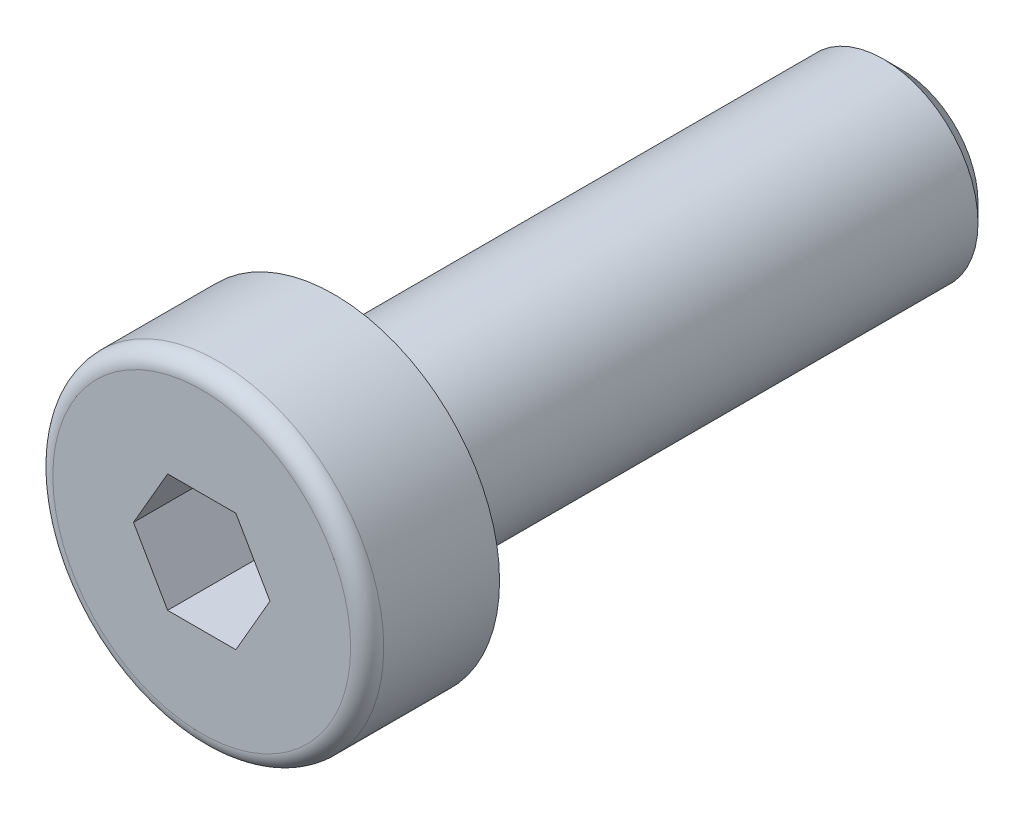
ISO-10303-21;
HEADER;
FILE_DESCRIPTION(('STEP AP214'),'2;1');
FILE_NAME('part.step','',(''),(''),'','','');
FILE_SCHEMA(('AUTOMOTIVE_DESIGN { 1 0 10303 214 1 1 1 1 }'));
ENDSEC;
DATA;
#1=APPLICATION_CONTEXT('core data for automotive mechanical design processes');
#2=APPLICATION_PROTOCOL_DEFINITION('international standard','automotive_design',2000,#1);
#3=PRODUCT_CONTEXT('',#1,'mechanical');
#4=PRODUCT('Part','Part','',(#3));
#5=PRODUCT_RELATED_PRODUCT_CATEGORY('part','',(#4));
#6=PRODUCT_DEFINITION_FORMATION('','',#4);
#7=PRODUCT_DEFINITION_CONTEXT('part definition',#1,'design');
#8=PRODUCT_DEFINITION('design','',#6,#7);
#9=PRODUCT_DEFINITION_SHAPE('','',#8);
#10=(LENGTH_UNIT() NAMED_UNIT(*) SI_UNIT(.MILLI.,.METRE.));
#11=(NAMED_UNIT(*) PLANE_ANGLE_UNIT() SI_UNIT($,.RADIAN.));
#12=(NAMED_UNIT(*) SI_UNIT($,.STERADIAN.) SOLID_ANGLE_UNIT());
#13=UNCERTAINTY_MEASURE_WITH_UNIT(LENGTH_MEASURE(1.E-05),#10,'distance_accuracy_value','');
#14=(GEOMETRIC_REPRESENTATION_CONTEXT(3) GLOBAL_UNCERTAINTY_ASSIGNED_CONTEXT((#13)) GLOBAL_UNIT_ASSIGNED_CONTEXT((#10,
#11,#12)) REPRESENTATION_CONTEXT('',''));
#15=CARTESIAN_POINT('',(0.,0.,0.));
#16=DIRECTION('',(0.,0.,1.));
#17=DIRECTION('',(1.,0.,0.));
#18=AXIS2_PLACEMENT_3D('',#15,#16,#17);
#19=CARTESIAN_POINT('',(0.,0.,2.8));
#20=DIRECTION('',(0.,0.,1.));
#21=DIRECTION('',(1.,0.,0.));
#22=AXIS2_PLACEMENT_3D('',#19,#20,#21);
#23=PLANE('',#22);
#24=CARTESIAN_POINT('',(0.,0.,2.8));
#25=DIRECTION('',(0.,0.,1.));
#26=DIRECTION('',(1.,0.,0.));
#27=AXIS2_PLACEMENT_3D('',#24,#25,#26);
#28=CIRCLE('',#27,3.15);
#29=CARTESIAN_POINT('',(3.15,0.,2.8));
#30=VERTEX_POINT('',#29);
#31=EDGE_CURVE('E125',#30,#30,#28,.T.);
#32=ORIENTED_EDGE('',*,*,#31,.T.);
#33=EDGE_LOOP('',(#32));
#34=FACE_BOUND('',#33,.T.);
#35=DIRECTION('',(1.,0.,0.));
#36=VECTOR('',#35,1.);
#37=CARTESIAN_POINT('',(-0.7216875,1.24999941718736,2.8));
#38=LINE('',#37,#36);
#39=CARTESIAN_POINT('',(-0.7216875,1.24999941718736,2.8));
#40=VERTEX_POINT('',#39);
#41=CARTESIAN_POINT('',(0.7216875,1.24999941718736,2.8));
#42=VERTEX_POINT('',#41);
#43=EDGE_CURVE('E122',#40,#42,#38,.T.);
#44=ORIENTED_EDGE('',*,*,#43,.T.);
#45=DIRECTION('',(0.5,-0.866025403784439,0.));
#46=VECTOR('',#45,1.);
#47=CARTESIAN_POINT('',(0.7216875,1.24999941718736,2.8));
#48=LINE('',#47,#46);
#49=CARTESIAN_POINT('',(1.443375,0.,2.8));
#50=VERTEX_POINT('',#49);
#51=EDGE_CURVE('E92',#42,#50,#48,.T.);
#52=ORIENTED_EDGE('',*,*,#51,.T.);
#53=DIRECTION('',(-0.5,-0.866025403784439,0.));
#54=VECTOR('',#53,1.);
#55=CARTESIAN_POINT('',(1.443375,0.,2.8));
#56=LINE('',#55,#54);
#57=CARTESIAN_POINT('',(0.7216875,-1.24999941718736,2.8));
#58=VERTEX_POINT('',#57);
#59=EDGE_CURVE('E104',#50,#58,#56,.T.);
#60=ORIENTED_EDGE('',*,*,#59,.T.);
#61=DIRECTION('',(-1.,0.,0.));
#62=VECTOR('',#61,1.);
#63=CARTESIAN_POINT('',(0.7216875,-1.24999941718736,2.8));
#64=LINE('',#63,#62);
#65=CARTESIAN_POINT('',(-0.7216875,-1.24999941718736,2.8));
#66=VERTEX_POINT('',#65);
#67=EDGE_CURVE('E402',#58,#66,#64,.T.);
#68=ORIENTED_EDGE('',*,*,#67,.T.);
#69=DIRECTION('',(-0.5,0.866025403784439,0.));
#70=VECTOR('',#69,1.);
#71=CARTESIAN_POINT('',(-0.7216875,-1.24999941718736,2.8));
#72=LINE('',#71,#70);
#73=CARTESIAN_POINT('',(-1.443375,0.,2.8));
#74=VERTEX_POINT('',#73);
#75=EDGE_CURVE('E406',#66,#74,#72,.T.);
#76=ORIENTED_EDGE('',*,*,#75,.T.);
#77=DIRECTION('',(0.5,0.866025403784439,0.));
#78=VECTOR('',#77,1.);
#79=CARTESIAN_POINT('',(-1.443375,0.,2.8));
#80=LINE('',#79,#78);
#81=EDGE_CURVE('E88',#74,#40,#80,.T.);
#82=ORIENTED_EDGE('',*,*,#81,.T.);
#83=EDGE_LOOP('',(#44,#52,#60,#68,#76,#82));
#84=FACE_BOUND('',#83,.T.);
#85=ADVANCED_FACE('F15',(#34,#84),#23,.T.);
#86=CARTESIAN_POINT('',(0.,1.621125,-12.));
#87=DIRECTION('',(0.,0.,-1.));
#88=DIRECTION('',(-1.,0.,0.));
#89=AXIS2_PLACEMENT_3D('',#86,#87,#88);
#90=PLANE('',#89);
#91=CARTESIAN_POINT('',(0.,0.,-12.));
#92=DIRECTION('',(0.,0.,1.));
#93=DIRECTION('',(1.,0.,0.));
#94=AXIS2_PLACEMENT_3D('',#91,#92,#93);
#95=CIRCLE('',#94,1.621125);
#96=CARTESIAN_POINT('',(1.621125,0.,-12.));
#97=VERTEX_POINT('',#96);
#98=EDGE_CURVE('E10',#97,#97,#95,.T.);
#99=ORIENTED_EDGE('',*,*,#98,.F.);
#100=EDGE_LOOP('',(#99));
#101=FACE_BOUND('',#100,.T.);
#102=ADVANCED_FACE('F17',(#101),#90,.T.);
#103=CARTESIAN_POINT('',(0.,0.,-11.621125));
#104=DIRECTION('',(0.,0.,1.));
#105=DIRECTION('',(1.,0.,0.));
#106=AXIS2_PLACEMENT_3D('',#103,#104,#105);
#107=CONICAL_SURFACE('',#106,2.,0.785398163397445);
#108=ORIENTED_EDGE('',*,*,#98,.T.);
#109=EDGE_LOOP('',(#108));
#110=FACE_BOUND('',#109,.T.);
#111=CARTESIAN_POINT('',(0.,0.,-11.621125));
#112=DIRECTION('',(0.,0.,1.));
#113=DIRECTION('',(1.,0.,0.));
#114=AXIS2_PLACEMENT_3D('',#111,#112,#113);
#115=CIRCLE('',#114,2.);
#116=CARTESIAN_POINT('',(2.,0.,-11.621125));
#117=VERTEX_POINT('',#116);
#118=EDGE_CURVE('E24',#117,#117,#115,.T.);
#119=ORIENTED_EDGE('',*,*,#118,.F.);
#120=EDGE_LOOP('',(#119));
#121=FACE_BOUND('',#120,.T.);
#122=ADVANCED_FACE('F166',(#110,#121),#107,.T.);
#123=CARTESIAN_POINT('',(0.,0.,2.8));
#124=DIRECTION('',(0.,0.,1.));
#125=DIRECTION('',(1.,0.,0.));
#126=AXIS2_PLACEMENT_3D('',#123,#124,#125);
#127=CYLINDRICAL_SURFACE('',#126,2.);
#128=ORIENTED_EDGE('',*,*,#118,.T.);
#129=EDGE_LOOP('',(#128));
#130=FACE_BOUND('',#129,.T.);
#131=CARTESIAN_POINT('',(0.,0.,-0.857230749717659));
#132=DIRECTION('',(0.,0.,1.));
#133=DIRECTION('',(1.,0.,0.));
#134=AXIS2_PLACEMENT_3D('',#131,#132,#133);
#135=CIRCLE('',#134,2.);
#136=CARTESIAN_POINT('',(2.,0.,-0.857230749717659));
#137=VERTEX_POINT('',#136);
#138=EDGE_CURVE('E153',#137,#137,#135,.T.);
#139=ORIENTED_EDGE('',*,*,#138,.F.);
#140=EDGE_LOOP('',(#139));
#141=FACE_BOUND('',#140,.T.);
#142=ADVANCED_FACE('F163',(#130,#141),#127,.T.);
#143=CARTESIAN_POINT('',(0.,1.621125,-0.857230749717659));
#144=DIRECTION('',(0.,0.,1.));
#145=DIRECTION('',(1.,0.,0.));
#146=AXIS2_PLACEMENT_3D('',#143,#144,#145);
#147=PLANE('',#146);
#148=ORIENTED_EDGE('',*,*,#138,.T.);
#149=EDGE_LOOP('',(#148));
#150=FACE_BOUND('',#149,.T.);
#151=CARTESIAN_POINT('',(0.,0.,-0.857230749717659));
#152=DIRECTION('',(0.,0.,1.));
#153=DIRECTION('',(1.,0.,0.));
#154=AXIS2_PLACEMENT_3D('',#151,#152,#153);
#155=CIRCLE('',#154,1.621125);
#156=CARTESIAN_POINT('',(1.621125,0.,-0.857230749717659));
#157=VERTEX_POINT('',#156);
#158=EDGE_CURVE('E149',#157,#157,#155,.T.);
#159=ORIENTED_EDGE('',*,*,#158,.F.);
#160=EDGE_LOOP('',(#159));
#161=FACE_BOUND('',#160,.T.);
#162=ADVANCED_FACE('F174',(#150,#161),#147,.T.);
#163=CARTESIAN_POINT('',(0.,0.,-0.201));
#164=DIRECTION('',(0.,0.,1.));
#165=DIRECTION('',(1.,0.,0.));
#166=AXIS2_PLACEMENT_3D('',#163,#164,#165);
#167=CONICAL_SURFACE('',#166,2.,0.523598775598299);
#168=ORIENTED_EDGE('',*,*,#158,.T.);
#169=EDGE_LOOP('',(#168));
#170=FACE_BOUND('',#169,.T.);
#171=CARTESIAN_POINT('',(0.,0.,-0.201));
#172=DIRECTION('',(0.,0.,1.));
#173=DIRECTION('',(1.,0.,0.));
#174=AXIS2_PLACEMENT_3D('',#171,#172,#173);
#175=CIRCLE('',#174,2.);
#176=CARTESIAN_POINT('',(2.,0.,-0.201));
#177=VERTEX_POINT('',#176);
#178=EDGE_CURVE('E145',#177,#177,#175,.T.);
#179=ORIENTED_EDGE('',*,*,#178,.F.);
#180=EDGE_LOOP('',(#179));
#181=FACE_BOUND('',#180,.T.);
#182=ADVANCED_FACE('F206',(#170,#181),#167,.T.);
#183=CARTESIAN_POINT('',(0.,0.,2.8));
#184=DIRECTION('',(0.,0.,1.));
#185=DIRECTION('',(1.,0.,0.));
#186=AXIS2_PLACEMENT_3D('',#183,#184,#185);
#187=CYLINDRICAL_SURFACE('',#186,2.);
#188=ORIENTED_EDGE('',*,*,#178,.T.);
#189=EDGE_LOOP('',(#188));
#190=FACE_BOUND('',#189,.T.);
#191=CARTESIAN_POINT('',(0.,0.,-0.2));
#192=DIRECTION('',(0.,0.,1.));
#193=DIRECTION('',(1.,0.,0.));
#194=AXIS2_PLACEMENT_3D('',#191,#192,#193);
#195=CIRCLE('',#194,2.);
#196=CARTESIAN_POINT('',(2.,0.,-0.2));
#197=VERTEX_POINT('',#196);
#198=EDGE_CURVE('E141',#197,#197,#195,.T.);
#199=ORIENTED_EDGE('',*,*,#198,.F.);
#200=EDGE_LOOP('',(#199));
#201=FACE_BOUND('',#200,.T.);
#202=ADVANCED_FACE('F202',(#190,#201),#187,.T.);
#203=CARTESIAN_POINT('',(0.,0.,-0.2));
#204=DIRECTION('',(0.,0.,1.));
#205=DIRECTION('',(1.,0.,0.));
#206=AXIS2_PLACEMENT_3D('',#203,#204,#205);
#207=TOROIDAL_SURFACE('',#206,2.2,0.2);
#208=ORIENTED_EDGE('',*,*,#198,.T.);
#209=EDGE_LOOP('',(#208));
#210=FACE_BOUND('',#209,.T.);
#211=CARTESIAN_POINT('',(0.,0.,0.));
#212=DIRECTION('',(0.,0.,1.));
#213=DIRECTION('',(1.,0.,0.));
#214=AXIS2_PLACEMENT_3D('',#211,#212,#213);
#215=CIRCLE('',#214,2.2);
#216=CARTESIAN_POINT('',(2.2,0.,0.));
#217=VERTEX_POINT('',#216);
#218=EDGE_CURVE('E137',#217,#217,#215,.T.);
#219=ORIENTED_EDGE('',*,*,#218,.F.);
#220=EDGE_LOOP('',(#219));
#221=FACE_BOUND('',#220,.T.);
#222=ADVANCED_FACE('F198',(#210,#221),#207,.F.);
#223=CARTESIAN_POINT('',(0.,3.5,0.));
#224=DIRECTION('',(0.,0.,-1.));
#225=DIRECTION('',(-1.,0.,0.));
#226=AXIS2_PLACEMENT_3D('',#223,#224,#225);
#227=PLANE('',#226);
#228=ORIENTED_EDGE('',*,*,#218,.T.);
#229=EDGE_LOOP('',(#228));
#230=FACE_BOUND('',#229,.T.);
#231=CARTESIAN_POINT('',(0.,0.,0.));
#232=DIRECTION('',(0.,0.,1.));
#233=DIRECTION('',(1.,0.,0.));
#234=AXIS2_PLACEMENT_3D('',#231,#232,#233);
#235=CIRCLE('',#234,3.5);
#236=CARTESIAN_POINT('',(3.5,0.,0.));
#237=VERTEX_POINT('',#236);
#238=EDGE_CURVE('E133',#237,#237,#235,.T.);
#239=ORIENTED_EDGE('',*,*,#238,.F.);
#240=EDGE_LOOP('',(#239));
#241=FACE_BOUND('',#240,.T.);
#242=ADVANCED_FACE('F194',(#230,#241),#227,.T.);
#243=CARTESIAN_POINT('',(0.,0.,2.8));
#244=DIRECTION('',(0.,0.,1.));
#245=DIRECTION('',(1.,0.,0.));
#246=AXIS2_PLACEMENT_3D('',#243,#244,#245);
#247=CYLINDRICAL_SURFACE('',#246,3.5);
#248=ORIENTED_EDGE('',*,*,#238,.T.);
#249=EDGE_LOOP('',(#248));
#250=FACE_BOUND('',#249,.T.);
#251=CARTESIAN_POINT('',(0.,0.,2.45));
#252=DIRECTION('',(0.,0.,1.));
#253=DIRECTION('',(1.,0.,0.));
#254=AXIS2_PLACEMENT_3D('',#251,#252,#253);
#255=CIRCLE('',#254,3.5);
#256=CARTESIAN_POINT('',(3.5,0.,2.45));
#257=VERTEX_POINT('',#256);
#258=EDGE_CURVE('E129',#257,#257,#255,.T.);
#259=ORIENTED_EDGE('',*,*,#258,.F.);
#260=EDGE_LOOP('',(#259));
#261=FACE_BOUND('',#260,.T.);
#262=ADVANCED_FACE('F190',(#250,#261),#247,.T.);
#263=CARTESIAN_POINT('',(0.,0.,2.45));
#264=DIRECTION('',(0.,0.,1.));
#265=DIRECTION('',(1.,0.,0.));
#266=AXIS2_PLACEMENT_3D('',#263,#264,#265);
#267=TOROIDAL_SURFACE('',#266,3.15,0.35);
#268=ORIENTED_EDGE('',*,*,#31,.F.);
#269=EDGE_LOOP('',(#268));
#270=FACE_BOUND('',#269,.T.);
#271=ORIENTED_EDGE('',*,*,#258,.T.);
#272=EDGE_LOOP('',(#271));
#273=FACE_BOUND('',#272,.T.);
#274=ADVANCED_FACE('F187',(#270,#273),#267,.T.);
#275=CARTESIAN_POINT('',(0.7216875,1.24999941718736,-0.333332944791576));
#276=DIRECTION('',(-0.866025403784439,-0.5,0.));
#277=DIRECTION('',(-0.5,0.866025403784439,0.));
#278=AXIS2_PLACEMENT_3D('',#275,#276,#277);
#279=PLANE('',#278);
#280=DIRECTION('',(0.,0.,1.));
#281=VECTOR('',#280,1.);
#282=CARTESIAN_POINT('',(0.7216875,1.24999941718736,-0.333332944791576));
#283=LINE('',#282,#281);
#284=CARTESIAN_POINT('',(0.7216875,1.24999941718736,0.5));
#285=VERTEX_POINT('',#284);
#286=EDGE_CURVE('E31',#285,#42,#283,.T.);
#287=ORIENTED_EDGE('',*,*,#286,.F.);
#288=CARTESIAN_POINT('',(1.44337615470054,-2.E-06,0.500000666667466));
#289=CARTESIAN_POINT('',(1.41166234028678,0.0549279378664331,0.481685336154006));
#290=CARTESIAN_POINT('',(1.37967477272109,0.110332030100753,0.465028493242003));
#291=CARTESIAN_POINT('',(1.31514579266581,0.222099502117095,0.435954455021552));
#292=CARTESIAN_POINT('',(1.28260323398259,0.278464867164722,0.423547543916306));
#293=CARTESIAN_POINT('',(1.2179214008177,0.390497088533009,0.404235266040966));
#294=CARTESIAN_POINT('',(1.18579207575664,0.446146711951656,0.397201350816835));
#295=CARTESIAN_POINT('',(1.12138232312734,0.55770767600856,0.388805848871122));
#296=CARTESIAN_POINT('',(1.08910212951503,0.613618611423234,0.387437308328204));
#297=CARTESIAN_POINT('',(1.02878989848834,0.718082459879302,0.390291401511073));
#298=CARTESIAN_POINT('',(1.00074881136366,0.766651047478698,0.393813260697768));
#299=CARTESIAN_POINT('',(0.944849315909161,0.863471813723365,0.404973295248275));
#300=CARTESIAN_POINT('',(0.916991100780737,0.91172365773398,0.41261527923588));
#301=CARTESIAN_POINT('',(0.860976444321451,1.00874388868998,0.431718785753659));
#302=CARTESIAN_POINT('',(0.832827088932361,1.05750000242419,0.443261250128448));
#303=CARTESIAN_POINT('',(0.776948107685497,1.15428523701895,0.469457774360603));
#304=CARTESIAN_POINT('',(0.749217766489108,1.20231559688232,0.484105682909886));
#305=CARTESIAN_POINT('',(0.721686345299461,1.25000141718736,0.500000666667466));
#306=B_SPLINE_CURVE_WITH_KNOTS('',3,(#288,#289,#290,#291,#292,#293,#294,#295,#296,#297,#298,
#299,#300,#301,#302,#303,#304,#305),.UNSPECIFIED.,.F.,.F.,(4,2,2,2,2,2,2,2,4),(0.,
0.198135072963001,0.396746271230005,0.590442442133857,0.783900794935013,0.952318546997791,
1.12089225123217,1.29320414395206,1.46517785562982),.UNSPECIFIED.);
#307=CARTESIAN_POINT('',(1.443375,0.,0.5));
#308=VERTEX_POINT('',#307);
#309=EDGE_CURVE('E79',#308,#285,#306,.T.);
#310=ORIENTED_EDGE('',*,*,#309,.F.);
#311=DIRECTION('',(0.,0.,1.));
#312=VECTOR('',#311,1.);
#313=CARTESIAN_POINT('',(1.443375,0.,-0.333332944791576));
#314=LINE('',#313,#312);
#315=EDGE_CURVE('E119',#308,#50,#314,.T.);
#316=ORIENTED_EDGE('',*,*,#315,.T.);
#317=ORIENTED_EDGE('',*,*,#51,.F.);
#318=EDGE_LOOP('',(#287,#310,#316,#317));
#319=FACE_BOUND('',#318,.T.);
#320=ADVANCED_FACE('F90',(#319),#279,.T.);
#321=CARTESIAN_POINT('',(1.443375,0.,-0.333332944791576));
#322=DIRECTION('',(-0.866025403784439,0.5,0.));
#323=DIRECTION('',(0.5,0.866025403784439,0.));
#324=AXIS2_PLACEMENT_3D('',#321,#322,#323);
#325=PLANE('',#324);
#326=ORIENTED_EDGE('',*,*,#315,.F.);
#327=CARTESIAN_POINT('',(0.721686345299462,-1.25000141718736,0.500000666667467));
#328=CARTESIAN_POINT('',(0.753400159713217,-1.19507147932093,0.481685336154007));
#329=CARTESIAN_POINT('',(0.785387727278908,-1.13966738708661,0.465028493242003));
#330=CARTESIAN_POINT('',(0.849916707334187,-1.02789991507027,0.435954455021551));
#331=CARTESIAN_POINT('',(0.882459266017407,-0.971534550022641,0.423547543916306));
#332=CARTESIAN_POINT('',(0.947141099182298,-0.859502328654355,0.404235266040966));
#333=CARTESIAN_POINT('',(0.979270424243355,-0.803852705235707,0.397201350816835));
#334=CARTESIAN_POINT('',(1.04368017687266,-0.692291741178803,0.388805848871122));
#335=CARTESIAN_POINT('',(1.07596037048497,-0.63638080576413,0.387437308328204));
#336=CARTESIAN_POINT('',(1.13627260151166,-0.531916957308062,0.390291401511073));
#337=CARTESIAN_POINT('',(1.16431368863634,-0.483348369708666,0.393813260697768));
#338=CARTESIAN_POINT('',(1.22021318409084,-0.386527603463999,0.404973295248275));
#339=CARTESIAN_POINT('',(1.24807139921926,-0.338275759453384,0.41261527923588));
#340=CARTESIAN_POINT('',(1.30408605567855,-0.241255528497385,0.431718785753659));
#341=CARTESIAN_POINT('',(1.33223541106764,-0.192499414763169,0.443261250128448));
#342=CARTESIAN_POINT('',(1.3881143923145,-0.0957141801684121,0.469457774360604));
#343=CARTESIAN_POINT('',(1.41584473351089,-0.0476838203050461,0.484105682909886));
#344=CARTESIAN_POINT('',(1.44337615470054,1.99999999983218E-06,0.500000666667466));
#345=B_SPLINE_CURVE_WITH_KNOTS('',3,(#327,#328,#329,#330,#331,#332,#333,#334,#335,#336,#337,
#338,#339,#340,#341,#342,#343,#344),.UNSPECIFIED.,.F.,.F.,(4,2,2,2,2,2,2,2,4),(0.,
0.198135072963001,0.396746271230005,0.590442442133857,0.783900794935012,0.95231854699779,
1.12089225123217,1.29320414395206,1.46517785562982),.UNSPECIFIED.);
#346=CARTESIAN_POINT('',(0.7216875,-1.24999941718736,0.5));
#347=VERTEX_POINT('',#346);
#348=EDGE_CURVE('E83',#347,#308,#345,.T.);
#349=ORIENTED_EDGE('',*,*,#348,.F.);
#350=DIRECTION('',(0.,0.,1.));
#351=VECTOR('',#350,1.);
#352=CARTESIAN_POINT('',(0.7216875,-1.24999941718736,-0.333332944791576));
#353=LINE('',#352,#351);
#354=EDGE_CURVE('E115',#347,#58,#353,.T.);
#355=ORIENTED_EDGE('',*,*,#354,.T.);
#356=ORIENTED_EDGE('',*,*,#59,.F.);
#357=EDGE_LOOP('',(#326,#349,#355,#356));
#358=FACE_BOUND('',#357,.T.);
#359=ADVANCED_FACE('F263',(#358),#325,.T.);
#360=CARTESIAN_POINT('',(0.7216875,-1.24999941718736,-0.333332944791576));
#361=DIRECTION('',(0.,1.,0.));
#362=DIRECTION('',(1.,0.,0.));
#363=AXIS2_PLACEMENT_3D('',#360,#361,#362);
#364=PLANE('',#363);
#365=ORIENTED_EDGE('',*,*,#354,.F.);
#366=CARTESIAN_POINT('',(-1.86893053107489,-1.24999941718736,0.96479389453662));
#367=CARTESIAN_POINT('',(-1.81495117776836,-1.24999941718736,0.938896634460859));
#368=CARTESIAN_POINT('',(-1.76084043441986,-1.24999941718736,0.913268430175833));
#369=CARTESIAN_POINT('',(-1.65228585942289,-1.24999941718736,0.862702593017937));
#370=CARTESIAN_POINT('',(-1.59784196995446,-1.24999941718736,0.837765084424383));
#371=CARTESIAN_POINT('',(-1.48823862830604,-1.24999941718736,0.788593784128477));
#372=CARTESIAN_POINT('',(-1.43307683885742,-1.24999941718736,0.764365178818002));
#373=CARTESIAN_POINT('',(-1.32229127521218,-1.24999941718736,0.71699497239768));
#374=CARTESIAN_POINT('',(-1.26666752521415,-1.24999941718736,0.693853314768326));
#375=CARTESIAN_POINT('',(-1.15340030068293,-1.24999941718736,0.648354547017749));
#376=CARTESIAN_POINT('',(-1.09574203904477,-1.24999941718736,0.626033759468394));
#377=CARTESIAN_POINT('',(-0.979740631963518,-1.24999941718736,0.583255440181502));
#378=CARTESIAN_POINT('',(-0.921397401730978,-1.24999941718736,0.56279814192238));
#379=CARTESIAN_POINT('',(-0.745435180245369,-1.24999941718736,0.505084236165397));
#380=CARTESIAN_POINT('',(-0.626561647576072,-1.24999941718736,0.471350228679807));
#381=CARTESIAN_POINT('',(-0.445872875814715,-1.24999941718736,0.43222043843359));
#382=CARTESIAN_POINT('',(-0.385304520505474,-1.24999941718736,0.421094097400587));
#383=CARTESIAN_POINT('',(-0.263486469039549,-1.24999941718736,0.403427897271526));
#384=CARTESIAN_POINT('',(-0.20223681921018,-1.24999941718736,0.396887728234056));
#385=CARTESIAN_POINT('',(-0.0801324091719261,-1.24999941718736,0.388998832783879));
#386=CARTESIAN_POINT('',(-0.0192817104364655,-1.24999941718736,0.387588843666313));
#387=CARTESIAN_POINT('',(0.102319185361569,-1.24999941718736,0.389916239230364));
#388=CARTESIAN_POINT('',(0.163069375967905,-1.24999941718736,0.393653942636413));
#389=CARTESIAN_POINT('',(0.312961455362286,-1.24999941718736,0.408898070766129));
#390=CARTESIAN_POINT('',(0.40181287263432,-1.24999941718736,0.423261284920512));
#391=CARTESIAN_POINT('',(0.577787885436386,-1.24999941718736,0.460299869967454));
#392=CARTESIAN_POINT('',(0.664909264565295,-1.24999941718736,0.482985259003197));
#393=CARTESIAN_POINT('',(0.795208864990652,-1.24999941718736,0.521737446580888));
#394=CARTESIAN_POINT('',(0.839060620655932,-1.24999941718736,0.535622931450171));
#395=CARTESIAN_POINT('',(0.926307663712635,-1.24999941718736,0.564678388012744));
#396=CARTESIAN_POINT('',(0.969703217226752,-1.24999941718736,0.579847558087051));
#397=CARTESIAN_POINT('',(1.05609584795378,-1.24999941718736,0.61125008410185));
#398=CARTESIAN_POINT('',(1.09909299597128,-1.24999941718736,0.62748324664252));
#399=CARTESIAN_POINT('',(1.18474848915208,-1.24999941718736,0.660838169890181));
#400=CARTESIAN_POINT('',(1.22740677566046,-1.24999941718736,0.677960080729484));
#401=CARTESIAN_POINT('',(1.33629337906013,-1.24999941718736,0.722761081255109));
#402=CARTESIAN_POINT('',(1.40230397627437,-1.24999941718736,0.750968762123528));
#403=CARTESIAN_POINT('',(1.53372907463052,-1.24999941718736,0.808743891219681));
#404=CARTESIAN_POINT('',(1.59914353067598,-1.24999941718736,0.838311441311434));
#405=CARTESIAN_POINT('',(1.79469131828896,-1.24999941718736,0.928574528623465));
#406=CARTESIAN_POINT('',(1.92410722703437,-1.24999941718736,0.990821249321752));
#407=CARTESIAN_POINT('',(2.18183340208154,-1.24999941718736,1.11792530727724));
#408=CARTESIAN_POINT('',(2.3101421136057,-1.24999941718736,1.1827857597699));
#409=CARTESIAN_POINT('',(2.565880437641,-1.24999941718736,1.31417443954414));
#410=CARTESIAN_POINT('',(2.69331015929244,-1.24999941718736,1.38070245483918));
#411=CARTESIAN_POINT('',(2.93556233058973,-1.24999941718736,1.50857379582091));
#412=CARTESIAN_POINT('',(3.05043950275986,-1.24999941718736,1.56981380943349));
#413=CARTESIAN_POINT('',(3.27982431975772,-1.24999941718736,1.69299160700423));
#414=CARTESIAN_POINT('',(3.39433195070739,-1.24999941718736,1.75492941678458));
#415=CARTESIAN_POINT('',(3.62277162051502,-1.24999941718736,1.87916961449806));
#416=CARTESIAN_POINT('',(3.73670438259663,-1.24999941718736,1.94147067442078));
#417=CARTESIAN_POINT('',(3.96433956104116,-1.24999941718736,2.06647828608533));
#418=CARTESIAN_POINT('',(4.07804198914646,-1.24999941718736,2.12918481643642));
#419=CARTESIAN_POINT('',(4.19166166337244,-1.24999941718736,2.19204003381012));
#420=B_SPLINE_CURVE_WITH_KNOTS('',3,(#366,#367,#368,#369,#370,#371,#372,#373,#374,#375,#376,
#377,#378,#379,#380,#381,#382,#383,#384,#385,#386,#387,#388,#389,#390,#391,#392,#393,#394,#395,
#396,#397,#398,#399,#400,#401,#402,#403,#404,#405,#406,#407,#408,#409,#410,#411,#412,#413,#414,
#415,#416,#417,#418,#419),.UNSPECIFIED.,.F.,.F.,(4,2,2,2,2,2,2,2,2,2,2,2,2,2,2,2,2,2,2,2,2,2,2,
2,2,2,4),(0.,0.179612840817484,0.359257792773137,0.539992477393522,0.720717753677289,
0.906167353114827,1.09164015584897,1.46153946542598,1.64614477745769,1.83073761234132,
2.01311873652213,2.1955111535168,2.46497183475509,2.73475795996105,2.87273569413166,
3.01062789275234,3.14849509611698,3.28638566505407,3.50171816734966,3.71706682595868,
4.14783526963883,4.57913326931211,5.01037671616215,5.40091711572386,5.79147201515411,
6.18103353481212,6.57057466801426),.UNSPECIFIED.);
#421=CARTESIAN_POINT('',(-0.7216875,-1.24999941718736,0.5));
#422=VERTEX_POINT('',#421);
#423=EDGE_CURVE('E442',#422,#347,#420,.T.);
#424=ORIENTED_EDGE('',*,*,#423,.F.);
#425=DIRECTION('',(0.,0.,1.));
#426=VECTOR('',#425,1.);
#427=CARTESIAN_POINT('',(-0.7216875,-1.24999941718736,-0.333332944791576));
#428=LINE('',#427,#426);
#429=EDGE_CURVE('E111',#422,#66,#428,.T.);
#430=ORIENTED_EDGE('',*,*,#429,.T.);
#431=ORIENTED_EDGE('',*,*,#67,.F.);
#432=EDGE_LOOP('',(#365,#424,#430,#431));
#433=FACE_BOUND('',#432,.T.);
#434=ADVANCED_FACE('F269',(#433),#364,.T.);
#435=CARTESIAN_POINT('',(-0.7216875,-1.24999941718736,-0.333332944791576));
#436=DIRECTION('',(0.866025403784439,0.5,0.));
#437=DIRECTION('',(0.5,-0.866025403784439,0.));
#438=AXIS2_PLACEMENT_3D('',#435,#436,#437);
#439=PLANE('',#438);
#440=ORIENTED_EDGE('',*,*,#429,.F.);
#441=CARTESIAN_POINT('',(-1.44337615470054,2.00000000041633E-06,0.500000666667466));
#442=CARTESIAN_POINT('',(-1.41166234028678,-0.0549279378664332,0.481685336154006));
#443=CARTESIAN_POINT('',(-1.37967477272109,-0.110332030100753,0.465028493242003));
#444=CARTESIAN_POINT('',(-1.31514579266581,-0.222099502117096,0.435954455021552));
#445=CARTESIAN_POINT('',(-1.28260323398259,-0.278464867164723,0.423547543916306));
#446=CARTESIAN_POINT('',(-1.2179214008177,-0.39049708853301,0.404235266040966));
#447=CARTESIAN_POINT('',(-1.18579207575664,-0.446146711951657,0.397201350816835));
#448=CARTESIAN_POINT('',(-1.12138232312734,-0.557707676008561,0.388805848871122));
#449=CARTESIAN_POINT('',(-1.08910212951503,-0.613618611423235,0.387437308328204));
#450=CARTESIAN_POINT('',(-1.02878989848834,-0.718082459879303,0.390291401511073));
#451=CARTESIAN_POINT('',(-1.00074881136366,-0.766651047478699,0.393813260697768));
#452=CARTESIAN_POINT('',(-0.94484931590916,-0.863471813723365,0.404973295248275));
#453=CARTESIAN_POINT('',(-0.916991100780736,-0.91172365773398,0.41261527923588));
#454=CARTESIAN_POINT('',(-0.860976444321451,-1.00874388868998,0.431718785753659));
#455=CARTESIAN_POINT('',(-0.832827088932361,-1.0575000024242,0.443261250128448));
#456=CARTESIAN_POINT('',(-0.776948107685497,-1.15428523701895,0.469457774360604));
#457=CARTESIAN_POINT('',(-0.749217766489108,-1.20231559688232,0.484105682909887));
#458=CARTESIAN_POINT('',(-0.721686345299461,-1.25000141718736,0.500000666667466));
#459=B_SPLINE_CURVE_WITH_KNOTS('',3,(#441,#442,#443,#444,#445,#446,#447,#448,#449,#450,#451,
#452,#453,#454,#455,#456,#457,#458),.UNSPECIFIED.,.F.,.F.,(4,2,2,2,2,2,2,2,4),(0.,
0.198135072963001,0.396746271230005,0.590442442133857,0.783900794935013,0.952318546997791,
1.12089225123217,1.29320414395206,1.46517785562982),.UNSPECIFIED.);
#460=CARTESIAN_POINT('',(-1.443375,0.,0.5));
#461=VERTEX_POINT('',#460);
#462=EDGE_CURVE('E438',#461,#422,#459,.T.);
#463=ORIENTED_EDGE('',*,*,#462,.F.);
#464=DIRECTION('',(0.,0.,1.));
#465=VECTOR('',#464,1.);
#466=CARTESIAN_POINT('',(-1.443375,0.,-0.333332944791576));
#467=LINE('',#466,#465);
#468=EDGE_CURVE('E101',#461,#74,#467,.T.);
#469=ORIENTED_EDGE('',*,*,#468,.T.);
#470=ORIENTED_EDGE('',*,*,#75,.F.);
#471=EDGE_LOOP('',(#440,#463,#469,#470));
#472=FACE_BOUND('',#471,.T.);
#473=ADVANCED_FACE('F276',(#472),#439,.T.);
#474=CARTESIAN_POINT('',(-1.443375,0.,-0.333332944791576));
#475=DIRECTION('',(0.866025403784439,-0.5,0.));
#476=DIRECTION('',(-0.5,-0.866025403784439,0.));
#477=AXIS2_PLACEMENT_3D('',#474,#475,#476);
#478=PLANE('',#477);
#479=ORIENTED_EDGE('',*,*,#468,.F.);
#480=CARTESIAN_POINT('',(-0.721686345299462,1.25000141718736,0.500000666667466));
#481=CARTESIAN_POINT('',(-0.753400159713217,1.19507147932093,0.481685336154007));
#482=CARTESIAN_POINT('',(-0.785387727278908,1.13966738708661,0.465028493242003));
#483=CARTESIAN_POINT('',(-0.849916707334187,1.02789991507027,0.435954455021552));
#484=CARTESIAN_POINT('',(-0.882459266017407,0.971534550022641,0.423547543916306));
#485=CARTESIAN_POINT('',(-0.947141099182298,0.859502328654354,0.404235266040966));
#486=CARTESIAN_POINT('',(-0.979270424243356,0.803852705235707,0.397201350816835));
#487=CARTESIAN_POINT('',(-1.04368017687266,0.692291741178803,0.388805848871122));
#488=CARTESIAN_POINT('',(-1.07596037048497,0.636380805764129,0.387437308328204));
#489=CARTESIAN_POINT('',(-1.13627260151166,0.531916957308061,0.390291401511073));
#490=CARTESIAN_POINT('',(-1.16431368863634,0.483348369708665,0.393813260697768));
#491=CARTESIAN_POINT('',(-1.22021318409084,0.386527603463999,0.404973295248275));
#492=CARTESIAN_POINT('',(-1.24807139921926,0.338275759453384,0.41261527923588));
#493=CARTESIAN_POINT('',(-1.30408605567855,0.241255528497386,0.431718785753659));
#494=CARTESIAN_POINT('',(-1.33223541106764,0.192499414763169,0.443261250128448));
#495=CARTESIAN_POINT('',(-1.3881143923145,0.0957141801684128,0.469457774360604));
#496=CARTESIAN_POINT('',(-1.41584473351089,0.0476838203050466,0.484105682909886));
#497=CARTESIAN_POINT('',(-1.44337615470054,-1.99999999952744E-06,0.500000666667466));
#498=B_SPLINE_CURVE_WITH_KNOTS('',3,(#480,#481,#482,#483,#484,#485,#486,#487,#488,#489,#490,
#491,#492,#493,#494,#495,#496,#497),.UNSPECIFIED.,.F.,.F.,(4,2,2,2,2,2,2,2,4),(0.,
0.198135072963001,0.396746271230005,0.590442442133858,0.783900794935013,0.952318546997791,
1.12089225123217,1.29320414395206,1.46517785562982),.UNSPECIFIED.);
#499=CARTESIAN_POINT('',(-0.7216875,1.24999941718736,0.5));
#500=VERTEX_POINT('',#499);
#501=EDGE_CURVE('E39',#500,#461,#498,.T.);
#502=ORIENTED_EDGE('',*,*,#501,.F.);
#503=DIRECTION('',(0.,0.,1.));
#504=VECTOR('',#503,1.);
#505=CARTESIAN_POINT('',(-0.7216875,1.24999941718736,-0.333332944791576));
#506=LINE('',#505,#504);
#507=EDGE_CURVE('E95',#500,#40,#506,.T.);
#508=ORIENTED_EDGE('',*,*,#507,.T.);
#509=ORIENTED_EDGE('',*,*,#81,.F.);
#510=EDGE_LOOP('',(#479,#502,#508,#509));
#511=FACE_BOUND('',#510,.T.);
#512=ADVANCED_FACE('F284',(#511),#478,.T.);
#513=CARTESIAN_POINT('',(-0.7216875,1.24999941718736,-0.333332944791576));
#514=DIRECTION('',(0.,-1.,0.));
#515=DIRECTION('',(-1.,0.,0.));
#516=AXIS2_PLACEMENT_3D('',#513,#514,#515);
#517=PLANE('',#516);
#518=ORIENTED_EDGE('',*,*,#507,.F.);
#519=CARTESIAN_POINT('',(-1.86893053107489,1.24999941718736,0.964793894536619));
#520=CARTESIAN_POINT('',(-1.81495117776836,1.24999941718736,0.938896634460858));
#521=CARTESIAN_POINT('',(-1.76084043441986,1.24999941718736,0.913268430175833));
#522=CARTESIAN_POINT('',(-1.65228585942289,1.24999941718736,0.862702593017937));
#523=CARTESIAN_POINT('',(-1.59784196995446,1.24999941718736,0.837765084424382));
#524=CARTESIAN_POINT('',(-1.48823862830604,1.24999941718736,0.788593784128476));
#525=CARTESIAN_POINT('',(-1.43307683885742,1.24999941718736,0.764365178818002));
#526=CARTESIAN_POINT('',(-1.32229127521218,1.24999941718736,0.71699497239768));
#527=CARTESIAN_POINT('',(-1.26666752521415,1.24999941718736,0.693853314768326));
#528=CARTESIAN_POINT('',(-1.15340030068293,1.24999941718736,0.648354547017748));
#529=CARTESIAN_POINT('',(-1.09574203904477,1.24999941718736,0.626033759468393));
#530=CARTESIAN_POINT('',(-0.979740631963518,1.24999941718736,0.583255440181502));
#531=CARTESIAN_POINT('',(-0.921397401730978,1.24999941718736,0.56279814192238));
#532=CARTESIAN_POINT('',(-0.745435180245369,1.24999941718736,0.505084236165396));
#533=CARTESIAN_POINT('',(-0.626561647576072,1.24999941718736,0.471350228679807));
#534=CARTESIAN_POINT('',(-0.445872875814715,1.24999941718736,0.43222043843359));
#535=CARTESIAN_POINT('',(-0.385304520505475,1.24999941718736,0.421094097400587));
#536=CARTESIAN_POINT('',(-0.26348646903955,1.24999941718736,0.403427897271526));
#537=CARTESIAN_POINT('',(-0.202236819210181,1.24999941718736,0.396887728234056));
#538=CARTESIAN_POINT('',(-0.0801324091719267,1.24999941718736,0.388998832783879));
#539=CARTESIAN_POINT('',(-0.0192817104364663,1.24999941718736,0.387588843666313));
#540=CARTESIAN_POINT('',(0.102319185361568,1.24999941718736,0.389916239230364));
#541=CARTESIAN_POINT('',(0.163069375967904,1.24999941718736,0.393653942636413));
#542=CARTESIAN_POINT('',(0.312961455362285,1.24999941718736,0.408898070766128));
#543=CARTESIAN_POINT('',(0.401812872634319,1.24999941718736,0.423261284920512));
#544=CARTESIAN_POINT('',(0.577787885436385,1.24999941718736,0.460299869967454));
#545=CARTESIAN_POINT('',(0.664909264565294,1.24999941718736,0.482985259003197));
#546=CARTESIAN_POINT('',(0.795208864990651,1.24999941718736,0.521737446580888));
#547=CARTESIAN_POINT('',(0.83906062065593,1.24999941718736,0.535622931450172));
#548=CARTESIAN_POINT('',(0.926307663712634,1.24999941718736,0.564678388012744));
#549=CARTESIAN_POINT('',(0.96970321722675,1.24999941718736,0.579847558087051));
#550=CARTESIAN_POINT('',(1.05609584795378,1.24999941718737,0.61125008410185));
#551=CARTESIAN_POINT('',(1.09909299597128,1.24999941718737,0.62748324664252));
#552=CARTESIAN_POINT('',(1.18474848915208,1.24999941718736,0.660838169890181));
#553=CARTESIAN_POINT('',(1.22740677566045,1.24999941718736,0.677960080729484));
#554=CARTESIAN_POINT('',(1.33629337906013,1.24999941718736,0.722761081255109));
#555=CARTESIAN_POINT('',(1.40230397627436,1.24999941718736,0.750968762123528));
#556=CARTESIAN_POINT('',(1.53372907463051,1.24999941718737,0.80874389121968));
#557=CARTESIAN_POINT('',(1.59914353067597,1.24999941718737,0.838311441311434));
#558=CARTESIAN_POINT('',(1.79469131828895,1.24999941718736,0.928574528623465));
#559=CARTESIAN_POINT('',(1.92410722703437,1.24999941718737,0.990821249321751));
#560=CARTESIAN_POINT('',(2.18183340208154,1.24999941718737,1.11792530727724));
#561=CARTESIAN_POINT('',(2.31014211360569,1.24999941718737,1.1827857597699));
#562=CARTESIAN_POINT('',(2.565880437641,1.24999941718737,1.31417443954414));
#563=CARTESIAN_POINT('',(2.69331015929244,1.24999941718737,1.38070245483918));
#564=CARTESIAN_POINT('',(2.93556233058972,1.24999941718737,1.50857379582091));
#565=CARTESIAN_POINT('',(3.05043950275985,1.24999941718737,1.56981380943349));
#566=CARTESIAN_POINT('',(3.27982431975771,1.24999941718737,1.69299160700422));
#567=CARTESIAN_POINT('',(3.39433195070738,1.24999941718737,1.75492941678457));
#568=CARTESIAN_POINT('',(3.62277162051502,1.24999941718737,1.87916961449806));
#569=CARTESIAN_POINT('',(3.73670438259662,1.24999941718737,1.94147067442078));
#570=CARTESIAN_POINT('',(3.96433956104115,1.24999941718737,2.06647828608533));
#571=CARTESIAN_POINT('',(4.07804198914646,1.24999941718737,2.12918481643642));
#572=CARTESIAN_POINT('',(4.19166166337243,1.24999941718737,2.19204003381012));
#573=B_SPLINE_CURVE_WITH_KNOTS('',3,(#519,#520,#521,#522,#523,#524,#525,#526,#527,#528,#529,
#530,#531,#532,#533,#534,#535,#536,#537,#538,#539,#540,#541,#542,#543,#544,#545,#546,#547,#548,
#549,#550,#551,#552,#553,#554,#555,#556,#557,#558,#559,#560,#561,#562,#563,#564,#565,#566,#567,
#568,#569,#570,#571,#572),.UNSPECIFIED.,.F.,.F.,(4,2,2,2,2,2,2,2,2,2,2,2,2,2,2,2,2,2,2,2,2,2,2,
2,2,2,4),(0.,0.179612840817484,0.359257792773137,0.539992477393522,0.720717753677289,
0.906167353114827,1.09164015584897,1.46153946542598,1.64614477745769,1.83073761234132,
2.01311873652213,2.1955111535168,2.46497183475509,2.73475795996105,2.87273569413165,
3.01062789275234,3.14849509611698,3.28638566505407,3.50171816734966,3.71706682595868,
4.14783526963882,4.5791332693121,5.01037671616214,5.40091711572385,5.7914720151541,
6.18103353481212,6.57057466801426),.UNSPECIFIED.);
#574=EDGE_CURVE('E80',#285,#500,#573,.F.);
#575=ORIENTED_EDGE('',*,*,#574,.F.);
#576=ORIENTED_EDGE('',*,*,#286,.T.);
#577=ORIENTED_EDGE('',*,*,#43,.F.);
#578=EDGE_LOOP('',(#518,#575,#576,#577));
#579=FACE_BOUND('',#578,.T.);
#580=ADVANCED_FACE('F75',(#579),#517,.T.);
#581=CARTESIAN_POINT('',(0.,0.,-0.333332944791576));
#582=DIRECTION('',(0.,0.,1.));
#583=DIRECTION('',(1.,0.,0.));
#584=AXIS2_PLACEMENT_3D('',#581,#582,#583);
#585=CONICAL_SURFACE('',#584,0.,1.0471975511966);
#586=CARTESIAN_POINT('',(0.,0.,-0.333332944791576));
#587=VERTEX_POINT('',#586);
#588=VERTEX_LOOP('',#587);
#589=FACE_BOUND('',#588,.T.);
#590=ORIENTED_EDGE('',*,*,#309,.T.);
#591=ORIENTED_EDGE('',*,*,#574,.T.);
#592=ORIENTED_EDGE('',*,*,#501,.T.);
#593=ORIENTED_EDGE('',*,*,#462,.T.);
#594=ORIENTED_EDGE('',*,*,#423,.T.);
#595=ORIENTED_EDGE('',*,*,#348,.T.);
#596=EDGE_LOOP('',(#590,#591,#592,#593,#594,#595));
#597=FACE_BOUND('',#596,.T.);
#598=ADVANCED_FACE('F72',(#589,#597),#585,.F.);
#599=CLOSED_SHELL('',(#85,#102,#122,#142,#162,#182,#202,#222,#242,#262,#274,#320,#359,#434,#473,
#512,#580,#598));
#600=MANIFOLD_SOLID_BREP('B1',#599);
#601=ADVANCED_BREP_SHAPE_REPRESENTATION('',(#18,#600),#14);
#602=SHAPE_DEFINITION_REPRESENTATION(#9,#601);
ENDSEC;
END-ISO-10303-21;
